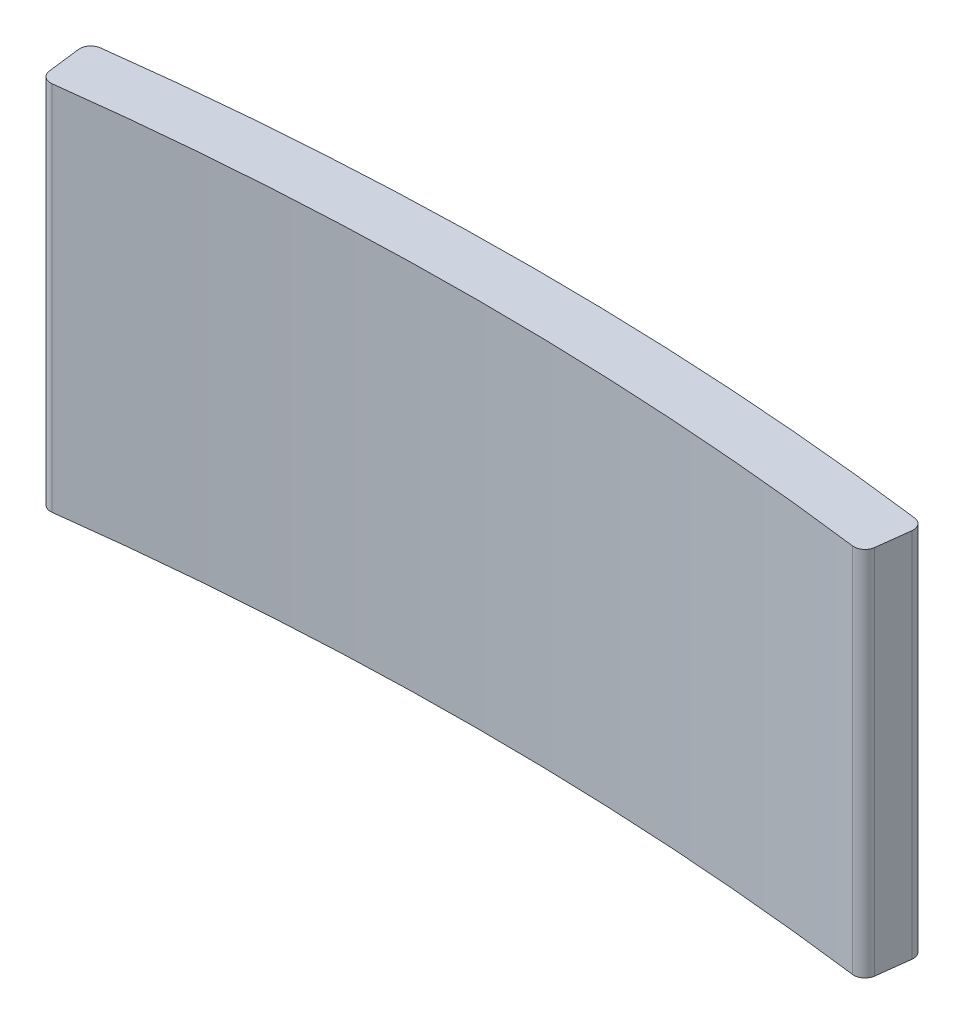
ISO-10303-21;
HEADER;
FILE_DESCRIPTION(('STEP AP214'),'2;1');
FILE_NAME('part.step','',(''),(''),'','','');
FILE_SCHEMA(('AUTOMOTIVE_DESIGN { 1 0 10303 214 1 1 1 1 }'));
ENDSEC;
DATA;
#1=APPLICATION_CONTEXT('core data for automotive mechanical design processes');
#2=APPLICATION_PROTOCOL_DEFINITION('international standard','automotive_design',2000,#1);
#3=PRODUCT_CONTEXT('',#1,'mechanical');
#4=PRODUCT('Part','Part','',(#3));
#5=PRODUCT_RELATED_PRODUCT_CATEGORY('part','',(#4));
#6=PRODUCT_DEFINITION_FORMATION('','',#4);
#7=PRODUCT_DEFINITION_CONTEXT('part definition',#1,'design');
#8=PRODUCT_DEFINITION('design','',#6,#7);
#9=PRODUCT_DEFINITION_SHAPE('','',#8);
#10=(LENGTH_UNIT() NAMED_UNIT(*) SI_UNIT(.MILLI.,.METRE.));
#11=(NAMED_UNIT(*) PLANE_ANGLE_UNIT() SI_UNIT($,.RADIAN.));
#12=(NAMED_UNIT(*) SI_UNIT($,.STERADIAN.) SOLID_ANGLE_UNIT());
#13=UNCERTAINTY_MEASURE_WITH_UNIT(LENGTH_MEASURE(1.E-05),#10,'distance_accuracy_value','');
#14=(GEOMETRIC_REPRESENTATION_CONTEXT(3) GLOBAL_UNCERTAINTY_ASSIGNED_CONTEXT((#13)) GLOBAL_UNIT_ASSIGNED_CONTEXT((#10,
#11,#12)) REPRESENTATION_CONTEXT('',''));
#15=CARTESIAN_POINT('',(0.,0.,0.));
#16=DIRECTION('',(0.,0.,1.));
#17=DIRECTION('',(1.,0.,0.));
#18=AXIS2_PLACEMENT_3D('',#15,#16,#17);
#19=CARTESIAN_POINT('',(0.,10.,0.));
#20=DIRECTION('',(0.,-1.,0.));
#21=DIRECTION('',(0.,0.,-1.));
#22=AXIS2_PLACEMENT_3D('',#19,#20,#21);
#23=CYLINDRICAL_SURFACE('',#22,85.);
#24=CARTESIAN_POINT('',(0.,0.,0.));
#25=DIRECTION('',(0.,-1.,0.));
#26=DIRECTION('',(0.,0.,1.));
#27=AXIS2_PLACEMENT_3D('',#24,#25,#26);
#28=CIRCLE('',#27,85.);
#29=CARTESIAN_POINT('',(-10.7820477898023,0.,-84.3133882930725));
#30=VERTEX_POINT('',#29);
#31=CARTESIAN_POINT('',(10.7810127284555,0.,-84.3135206508949));
#32=VERTEX_POINT('',#31);
#33=EDGE_CURVE('E128',#30,#32,#28,.T.);
#34=ORIENTED_EDGE('',*,*,#33,.T.);
#35=DIRECTION('',(0.,-1.,0.));
#36=VECTOR('',#35,1.);
#37=CARTESIAN_POINT('',(10.7810127284555,10.,-84.3135206508949));
#38=LINE('',#37,#36);
#39=CARTESIAN_POINT('',(10.7810127284555,10.,-84.3135206508949));
#40=VERTEX_POINT('',#39);
#41=EDGE_CURVE('E151',#32,#40,#38,.F.);
#42=ORIENTED_EDGE('',*,*,#41,.T.);
#43=CARTESIAN_POINT('',(0.,10.,0.));
#44=DIRECTION('',(0.,-1.,0.));
#45=DIRECTION('',(0.,0.,1.));
#46=AXIS2_PLACEMENT_3D('',#43,#44,#45);
#47=CIRCLE('',#46,85.);
#48=CARTESIAN_POINT('',(-10.7820477898023,10.,-84.3133882930725));
#49=VERTEX_POINT('',#48);
#50=EDGE_CURVE('E126',#49,#40,#47,.T.);
#51=ORIENTED_EDGE('',*,*,#50,.F.);
#52=DIRECTION('',(0.,-1.,0.));
#53=VECTOR('',#52,1.);
#54=CARTESIAN_POINT('',(-10.7820477898023,10.,-84.3133882930725));
#55=LINE('',#54,#53);
#56=EDGE_CURVE('E148',#49,#30,#55,.T.);
#57=ORIENTED_EDGE('',*,*,#56,.T.);
#58=EDGE_LOOP('',(#34,#42,#51,#57));
#59=FACE_BOUND('',#58,.T.);
#60=ADVANCED_FACE('F33',(#59),#23,.F.);
#61=CARTESIAN_POINT('',(11.0800177891906,10.,-84.274748328258));
#62=DIRECTION('',(-0.992546151641323,0.,-0.121869343405139));
#63=DIRECTION('',(-0.121869343405139,0.,0.992546151641323));
#64=AXIS2_PLACEMENT_3D('',#61,#62,#63);
#65=PLANE('',#64);
#66=DIRECTION('',(0.121869343405139,0.,-0.992546151641323));
#67=VECTOR('',#66,1.);
#68=CARTESIAN_POINT('',(11.0800177891906,0.,-84.274748328258));
#69=LINE('',#68,#67);
#70=CARTESIAN_POINT('',(11.1168272071072,0.,-84.5745369795824));
#71=VERTEX_POINT('',#70);
#72=CARTESIAN_POINT('',(11.2265109755908,0.,-85.4678395876389));
#73=VERTEX_POINT('',#72);
#74=EDGE_CURVE('E124',#71,#73,#69,.T.);
#75=ORIENTED_EDGE('',*,*,#74,.T.);
#76=DIRECTION('',(0.,-1.,0.));
#77=VECTOR('',#76,1.);
#78=CARTESIAN_POINT('',(11.2265109755908,10.,-85.4678395876389));
#79=LINE('',#78,#77);
#80=CARTESIAN_POINT('',(11.2265109755908,10.,-85.4678395876389));
#81=VERTEX_POINT('',#80);
#82=EDGE_CURVE('E103',#73,#81,#79,.F.);
#83=ORIENTED_EDGE('',*,*,#82,.T.);
#84=DIRECTION('',(0.121869343405139,0.,-0.992546151641323));
#85=VECTOR('',#84,1.);
#86=CARTESIAN_POINT('',(11.0800177891906,10.,-84.274748328258));
#87=LINE('',#86,#85);
#88=CARTESIAN_POINT('',(11.1168272071072,10.,-84.5745369795824));
#89=VERTEX_POINT('',#88);
#90=EDGE_CURVE('E167',#89,#81,#87,.T.);
#91=ORIENTED_EDGE('',*,*,#90,.F.);
#92=DIRECTION('',(0.,-1.,0.));
#93=VECTOR('',#92,1.);
#94=CARTESIAN_POINT('',(11.1168272071072,10.,-84.5745369795824));
#95=LINE('',#94,#93);
#96=EDGE_CURVE('E108',#89,#71,#95,.T.);
#97=ORIENTED_EDGE('',*,*,#96,.T.);
#98=EDGE_LOOP('',(#75,#83,#91,#97));
#99=FACE_BOUND('',#98,.T.);
#100=ADVANCED_FACE('F184',(#99),#65,.F.);
#101=CARTESIAN_POINT('',(0.,10.,0.));
#102=DIRECTION('',(0.,-1.,0.));
#103=DIRECTION('',(0.,0.,-1.));
#104=AXIS2_PLACEMENT_3D('',#101,#102,#103);
#105=CYLINDRICAL_SURFACE('',#104,86.5);
#106=CARTESIAN_POINT('',(0.,10.,0.));
#107=DIRECTION('',(0.,1.,0.));
#108=DIRECTION('',(0.,0.,1.));
#109=AXIS2_PLACEMENT_3D('',#106,#107,#108);
#110=CIRCLE('',#109,86.5);
#111=CARTESIAN_POINT('',(10.9667822129177,10.,-85.8019795103495));
#112=VERTEX_POINT('',#111);
#113=CARTESIAN_POINT('',(-10.9678245491382,10.,-85.801846277684));
#114=VERTEX_POINT('',#113);
#115=EDGE_CURVE('E117',#112,#114,#110,.T.);
#116=ORIENTED_EDGE('',*,*,#115,.F.);
#117=DIRECTION('',(0.,-1.,0.));
#118=VECTOR('',#117,1.);
#119=CARTESIAN_POINT('',(10.9667822129178,10.,-85.8019795103495));
#120=LINE('',#119,#118);
#121=CARTESIAN_POINT('',(10.9667822129177,0.,-85.8019795103495));
#122=VERTEX_POINT('',#121);
#123=EDGE_CURVE('E102',#112,#122,#120,.T.);
#124=ORIENTED_EDGE('',*,*,#123,.T.);
#125=CARTESIAN_POINT('',(0.,0.,0.));
#126=DIRECTION('',(0.,1.,0.));
#127=DIRECTION('',(0.,0.,1.));
#128=AXIS2_PLACEMENT_3D('',#125,#126,#127);
#129=CIRCLE('',#128,86.5);
#130=CARTESIAN_POINT('',(-10.9678245491382,0.,-85.801846277684));
#131=VERTEX_POINT('',#130);
#132=EDGE_CURVE('E115',#122,#131,#129,.T.);
#133=ORIENTED_EDGE('',*,*,#132,.T.);
#134=DIRECTION('',(0.,-1.,0.));
#135=VECTOR('',#134,1.);
#136=CARTESIAN_POINT('',(-10.9678245491382,10.,-85.801846277684));
#137=LINE('',#136,#135);
#138=EDGE_CURVE('E119',#131,#114,#137,.F.);
#139=ORIENTED_EDGE('',*,*,#138,.T.);
#140=EDGE_LOOP('',(#116,#124,#133,#139));
#141=FACE_BOUND('',#140,.T.);
#142=ADVANCED_FACE('F114',(#141),#105,.T.);
#143=CARTESIAN_POINT('',(-11.0810560509944,10.,-84.2746118163396));
#144=DIRECTION('',(0.992546151641323,0.,-0.121869343405139));
#145=DIRECTION('',(-0.121869343405139,0.,-0.992546151641323));
#146=AXIS2_PLACEMENT_3D('',#143,#144,#145);
#147=PLANE('',#146);
#148=DIRECTION('',(0.121869343405139,0.,0.992546151641323));
#149=VECTOR('',#148,1.);
#150=CARTESIAN_POINT('',(-11.0810560509944,0.,-84.2746118163396));
#151=LINE('',#150,#149);
#152=CARTESIAN_POINT('',(-11.2275496967723,0.,-85.467706817052));
#153=VERTEX_POINT('',#152);
#154=CARTESIAN_POINT('',(-11.1178659216116,0.,-84.5744041546148));
#155=VERTEX_POINT('',#154);
#156=EDGE_CURVE('E123',#153,#155,#151,.T.);
#157=ORIENTED_EDGE('',*,*,#156,.T.);
#158=DIRECTION('',(0.,-1.,0.));
#159=VECTOR('',#158,1.);
#160=CARTESIAN_POINT('',(-11.1178659216116,10.,-84.5744041546148));
#161=LINE('',#160,#159);
#162=CARTESIAN_POINT('',(-11.1178659216116,10.,-84.5744041546148));
#163=VERTEX_POINT('',#162);
#164=EDGE_CURVE('E11',#155,#163,#161,.F.);
#165=ORIENTED_EDGE('',*,*,#164,.T.);
#166=DIRECTION('',(0.121869343405139,0.,0.992546151641323));
#167=VECTOR('',#166,1.);
#168=CARTESIAN_POINT('',(-11.0810560509944,10.,-84.2746118163396));
#169=LINE('',#168,#167);
#170=CARTESIAN_POINT('',(-11.2275496967723,10.,-85.467706817052));
#171=VERTEX_POINT('',#170);
#172=EDGE_CURVE('E132',#171,#163,#169,.T.);
#173=ORIENTED_EDGE('',*,*,#172,.F.);
#174=DIRECTION('',(0.,-1.,0.));
#175=VECTOR('',#174,1.);
#176=CARTESIAN_POINT('',(-11.2275496967723,10.,-85.467706817052));
#177=LINE('',#176,#175);
#178=EDGE_CURVE('E41',#171,#153,#177,.T.);
#179=ORIENTED_EDGE('',*,*,#178,.T.);
#180=EDGE_LOOP('',(#157,#165,#173,#179));
#181=FACE_BOUND('',#180,.T.);
#182=ADVANCED_FACE('F154',(#181),#147,.F.);
#183=CARTESIAN_POINT('',(0.,10.,0.));
#184=DIRECTION('',(0.,1.,0.));
#185=DIRECTION('',(0.,0.,1.));
#186=AXIS2_PLACEMENT_3D('',#183,#184,#185);
#187=PLANE('',#186);
#188=ORIENTED_EDGE('',*,*,#90,.T.);
#189=CARTESIAN_POINT('',(10.9287471300984,10.,-85.5044003906604));
#190=DIRECTION('',(0.,1.,0.));
#191=DIRECTION('',(0.,0.,1.));
#192=AXIS2_PLACEMENT_3D('',#189,#190,#191);
#193=CIRCLE('',#192,0.3);
#194=EDGE_CURVE('E146',#81,#112,#193,.T.);
#195=ORIENTED_EDGE('',*,*,#194,.T.);
#196=ORIENTED_EDGE('',*,*,#115,.T.);
#197=CARTESIAN_POINT('',(-10.9297858512799,10.,-85.5042676200736));
#198=DIRECTION('',(0.,1.,0.));
#199=DIRECTION('',(0.,0.,1.));
#200=AXIS2_PLACEMENT_3D('',#197,#198,#199);
#201=CIRCLE('',#200,0.3);
#202=EDGE_CURVE('E53',#114,#171,#201,.T.);
#203=ORIENTED_EDGE('',*,*,#202,.T.);
#204=ORIENTED_EDGE('',*,*,#172,.T.);
#205=CARTESIAN_POINT('',(-10.8201020761192,10.,-84.6109649576363));
#206=DIRECTION('',(0.,1.,0.));
#207=DIRECTION('',(0.,0.,1.));
#208=AXIS2_PLACEMENT_3D('',#205,#206,#207);
#209=CIRCLE('',#208,0.3);
#210=EDGE_CURVE('E142',#163,#49,#209,.T.);
#211=ORIENTED_EDGE('',*,*,#210,.T.);
#212=ORIENTED_EDGE('',*,*,#50,.T.);
#213=CARTESIAN_POINT('',(10.8190633616148,10.,-84.611097782604));
#214=DIRECTION('',(0.,1.,0.));
#215=DIRECTION('',(0.,0.,1.));
#216=AXIS2_PLACEMENT_3D('',#213,#214,#215);
#217=CIRCLE('',#216,0.3);
#218=EDGE_CURVE('E144',#40,#89,#217,.T.);
#219=ORIENTED_EDGE('',*,*,#218,.T.);
#220=EDGE_LOOP('',(#188,#195,#196,#203,#204,#211,#212,#219));
#221=FACE_BOUND('',#220,.T.);
#222=ADVANCED_FACE('F173',(#221),#187,.T.);
#223=CARTESIAN_POINT('',(0.,0.,0.));
#224=DIRECTION('',(0.,1.,0.));
#225=DIRECTION('',(0.,0.,1.));
#226=AXIS2_PLACEMENT_3D('',#223,#224,#225);
#227=PLANE('',#226);
#228=ORIENTED_EDGE('',*,*,#132,.F.);
#229=CARTESIAN_POINT('',(10.9287471300984,0.,-85.5044003906604));
#230=DIRECTION('',(0.,1.,0.));
#231=DIRECTION('',(0.,0.,1.));
#232=AXIS2_PLACEMENT_3D('',#229,#230,#231);
#233=CIRCLE('',#232,0.3);
#234=EDGE_CURVE('E98',#122,#73,#233,.F.);
#235=ORIENTED_EDGE('',*,*,#234,.T.);
#236=ORIENTED_EDGE('',*,*,#74,.F.);
#237=CARTESIAN_POINT('',(10.8190633616148,0.,-84.611097782604));
#238=DIRECTION('',(0.,1.,0.));
#239=DIRECTION('',(0.,0.,1.));
#240=AXIS2_PLACEMENT_3D('',#237,#238,#239);
#241=CIRCLE('',#240,0.3);
#242=EDGE_CURVE('E109',#71,#32,#241,.F.);
#243=ORIENTED_EDGE('',*,*,#242,.T.);
#244=ORIENTED_EDGE('',*,*,#33,.F.);
#245=CARTESIAN_POINT('',(-10.8201020761192,0.,-84.6109649576363));
#246=DIRECTION('',(0.,1.,0.));
#247=DIRECTION('',(0.,0.,1.));
#248=AXIS2_PLACEMENT_3D('',#245,#246,#247);
#249=CIRCLE('',#248,0.3);
#250=EDGE_CURVE('E135',#30,#155,#249,.F.);
#251=ORIENTED_EDGE('',*,*,#250,.T.);
#252=ORIENTED_EDGE('',*,*,#156,.F.);
#253=CARTESIAN_POINT('',(-10.9297858512799,0.,-85.5042676200736));
#254=DIRECTION('',(0.,1.,0.));
#255=DIRECTION('',(0.,0.,1.));
#256=AXIS2_PLACEMENT_3D('',#253,#254,#255);
#257=CIRCLE('',#256,0.3);
#258=EDGE_CURVE('E118',#153,#131,#257,.F.);
#259=ORIENTED_EDGE('',*,*,#258,.T.);
#260=EDGE_LOOP('',(#228,#235,#236,#243,#244,#251,#252,#259));
#261=FACE_BOUND('',#260,.T.);
#262=ADVANCED_FACE('F121',(#261),#227,.F.);
#263=CARTESIAN_POINT('',(10.9287471300984,10.,-85.5044003906604));
#264=DIRECTION('',(0.,-1.,0.));
#265=DIRECTION('',(0.,0.,-1.));
#266=AXIS2_PLACEMENT_3D('',#263,#264,#265);
#267=CYLINDRICAL_SURFACE('',#266,0.3);
#268=ORIENTED_EDGE('',*,*,#194,.F.);
#269=ORIENTED_EDGE('',*,*,#82,.F.);
#270=ORIENTED_EDGE('',*,*,#234,.F.);
#271=ORIENTED_EDGE('',*,*,#123,.F.);
#272=EDGE_LOOP('',(#268,#269,#270,#271));
#273=FACE_BOUND('',#272,.T.);
#274=ADVANCED_FACE('F101',(#273),#267,.T.);
#275=CARTESIAN_POINT('',(10.8190633616148,10.,-84.611097782604));
#276=DIRECTION('',(0.,-1.,0.));
#277=DIRECTION('',(0.,0.,-1.));
#278=AXIS2_PLACEMENT_3D('',#275,#276,#277);
#279=CYLINDRICAL_SURFACE('',#278,0.3);
#280=ORIENTED_EDGE('',*,*,#218,.F.);
#281=ORIENTED_EDGE('',*,*,#41,.F.);
#282=ORIENTED_EDGE('',*,*,#242,.F.);
#283=ORIENTED_EDGE('',*,*,#96,.F.);
#284=EDGE_LOOP('',(#280,#281,#282,#283));
#285=FACE_BOUND('',#284,.T.);
#286=ADVANCED_FACE('F195',(#285),#279,.T.);
#287=CARTESIAN_POINT('',(-10.8201020761192,10.,-84.6109649576363));
#288=DIRECTION('',(0.,-1.,0.));
#289=DIRECTION('',(0.,0.,-1.));
#290=AXIS2_PLACEMENT_3D('',#287,#288,#289);
#291=CYLINDRICAL_SURFACE('',#290,0.3);
#292=ORIENTED_EDGE('',*,*,#210,.F.);
#293=ORIENTED_EDGE('',*,*,#164,.F.);
#294=ORIENTED_EDGE('',*,*,#250,.F.);
#295=ORIENTED_EDGE('',*,*,#56,.F.);
#296=EDGE_LOOP('',(#292,#293,#294,#295));
#297=FACE_BOUND('',#296,.T.);
#298=ADVANCED_FACE('F161',(#297),#291,.T.);
#299=CARTESIAN_POINT('',(-10.9297858512799,10.,-85.5042676200736));
#300=DIRECTION('',(0.,-1.,0.));
#301=DIRECTION('',(0.,0.,-1.));
#302=AXIS2_PLACEMENT_3D('',#299,#300,#301);
#303=CYLINDRICAL_SURFACE('',#302,0.3);
#304=ORIENTED_EDGE('',*,*,#202,.F.);
#305=ORIENTED_EDGE('',*,*,#138,.F.);
#306=ORIENTED_EDGE('',*,*,#258,.F.);
#307=ORIENTED_EDGE('',*,*,#178,.F.);
#308=EDGE_LOOP('',(#304,#305,#306,#307));
#309=FACE_BOUND('',#308,.T.);
#310=ADVANCED_FACE('F35',(#309),#303,.T.);
#311=CLOSED_SHELL('',(#60,#100,#142,#182,#222,#262,#274,#286,#298,#310));
#312=MANIFOLD_SOLID_BREP('B2',#311);
#313=ADVANCED_BREP_SHAPE_REPRESENTATION('',(#18,#312),#14);
#314=SHAPE_DEFINITION_REPRESENTATION(#9,#313);
ENDSEC;
END-ISO-10303-21;
